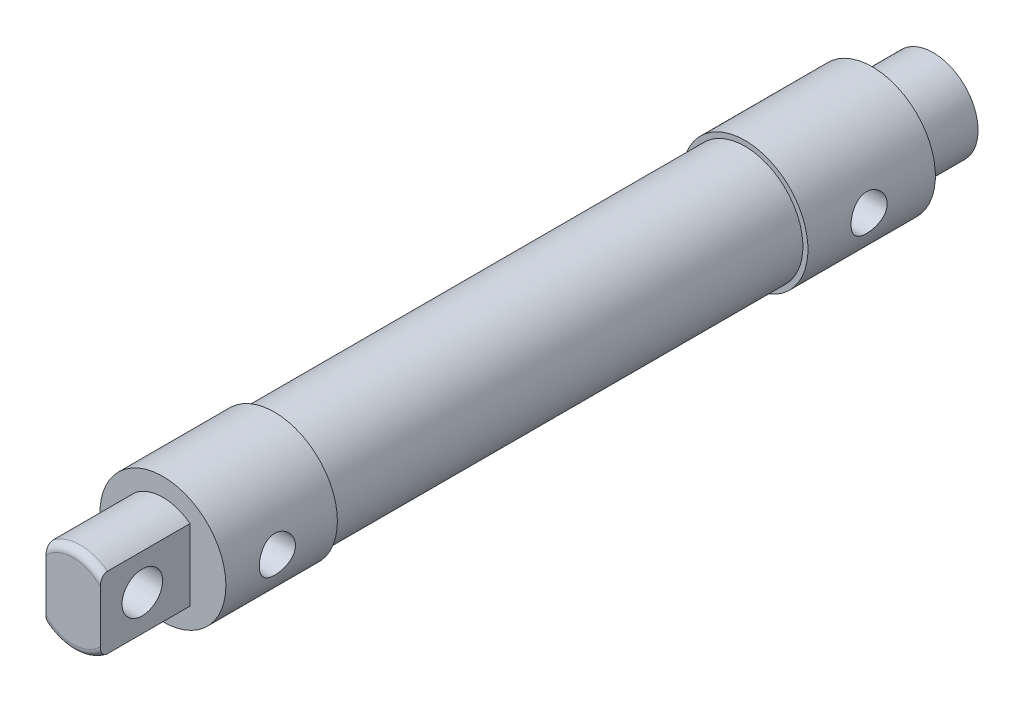
ISO-10303-21;
HEADER;
FILE_DESCRIPTION(('STEP AP214'),'2;1');
FILE_NAME('part.step','',(''),(''),'','','');
FILE_SCHEMA(('AUTOMOTIVE_DESIGN { 1 0 10303 214 1 1 1 1 }'));
ENDSEC;
DATA;
#1=APPLICATION_CONTEXT('core data for automotive mechanical design processes');
#2=APPLICATION_PROTOCOL_DEFINITION('international standard','automotive_design',2000,#1);
#3=PRODUCT_CONTEXT('',#1,'mechanical');
#4=PRODUCT('Part','Part','',(#3));
#5=PRODUCT_RELATED_PRODUCT_CATEGORY('part','',(#4));
#6=PRODUCT_DEFINITION_FORMATION('','',#4);
#7=PRODUCT_DEFINITION_CONTEXT('part definition',#1,'design');
#8=PRODUCT_DEFINITION('design','',#6,#7);
#9=PRODUCT_DEFINITION_SHAPE('','',#8);
#10=(LENGTH_UNIT() NAMED_UNIT(*) SI_UNIT(.MILLI.,.METRE.));
#11=(NAMED_UNIT(*) PLANE_ANGLE_UNIT() SI_UNIT($,.RADIAN.));
#12=(NAMED_UNIT(*) SI_UNIT($,.STERADIAN.) SOLID_ANGLE_UNIT());
#13=UNCERTAINTY_MEASURE_WITH_UNIT(LENGTH_MEASURE(1.E-05),#10,'distance_accuracy_value','');
#14=(GEOMETRIC_REPRESENTATION_CONTEXT(3) GLOBAL_UNCERTAINTY_ASSIGNED_CONTEXT((#13)) GLOBAL_UNIT_ASSIGNED_CONTEXT((#10,
#11,#12)) REPRESENTATION_CONTEXT('',''));
#15=CARTESIAN_POINT('',(0.,0.,0.));
#16=DIRECTION('',(0.,0.,1.));
#17=DIRECTION('',(1.,0.,0.));
#18=AXIS2_PLACEMENT_3D('',#15,#16,#17);
#19=CARTESIAN_POINT('',(0.,0.,102.108));
#20=DIRECTION('',(0.,0.,-1.));
#21=DIRECTION('',(-1.,0.,0.));
#22=AXIS2_PLACEMENT_3D('',#19,#20,#21);
#23=CYLINDRICAL_SURFACE('',#22,11.049);
#24=CARTESIAN_POINT('',(0.,0.,102.108));
#25=DIRECTION('',(0.,0.,1.));
#26=DIRECTION('',(1.,0.,0.));
#27=AXIS2_PLACEMENT_3D('',#24,#25,#26);
#28=CIRCLE('',#27,11.049);
#29=CARTESIAN_POINT('',(11.049,0.,102.108));
#30=VERTEX_POINT('',#29);
#31=EDGE_CURVE('E244',#30,#30,#28,.T.);
#32=ORIENTED_EDGE('',*,*,#31,.F.);
#33=EDGE_LOOP('',(#32));
#34=FACE_BOUND('',#33,.T.);
#35=CARTESIAN_POINT('',(0.,0.,82.55));
#36=DIRECTION('',(0.,0.,1.));
#37=DIRECTION('',(1.,0.,0.));
#38=AXIS2_PLACEMENT_3D('',#35,#36,#37);
#39=CIRCLE('',#38,11.049);
#40=CARTESIAN_POINT('',(11.049,0.,82.55));
#41=VERTEX_POINT('',#40);
#42=EDGE_CURVE('E245',#41,#41,#39,.T.);
#43=ORIENTED_EDGE('',*,*,#42,.T.);
#44=EDGE_LOOP('',(#43));
#45=FACE_BOUND('',#44,.T.);
#46=CARTESIAN_POINT('',(10.5829946612478,-3.175,93.0760778464226));
#47=CARTESIAN_POINT('',(10.5829970378921,-3.17499696173694,93.2504210160346));
#48=CARTESIAN_POINT('',(10.5873499628536,-3.16059101598809,93.4247947914254));
#49=CARTESIAN_POINT('',(10.6042287733974,-3.10348071440142,93.7684686648293));
#50=CARTESIAN_POINT('',(10.6167579154399,-3.06076508315063,93.9377667131465));
#51=CARTESIAN_POINT('',(10.6484555361327,-2.94858604276688,94.266265950174));
#52=CARTESIAN_POINT('',(10.6676136440502,-2.87916439519901,94.4254824534469));
#53=CARTESIAN_POINT('',(10.7103968556723,-2.71567886194747,94.7300428356047));
#54=CARTESIAN_POINT('',(10.7340225055439,-2.62161196278527,94.8753850150505));
#55=CARTESIAN_POINT('',(10.7838478929209,-2.40858326173655,95.1522908243156));
#56=CARTESIAN_POINT('',(10.8100989589948,-2.28903221307923,95.2833920018629));
#57=CARTESIAN_POINT('',(10.8617771284488,-2.02969339145336,95.5239875474528));
#58=CARTESIAN_POINT('',(10.8872041340175,-1.88990322690515,95.63347935838));
#59=CARTESIAN_POINT('',(10.9349482869144,-1.59079703436564,95.8297248552312));
#60=CARTESIAN_POINT('',(10.9571978703645,-1.43116293599986,95.9160116284078));
#61=CARTESIAN_POINT('',(10.9954868205641,-1.09890403668004,96.0603402425021));
#62=CARTESIAN_POINT('',(11.0115274108589,-0.926281803186664,96.1183876488545));
#63=CARTESIAN_POINT('',(11.0352279538983,-0.577780737066135,96.2030726139401));
#64=CARTESIAN_POINT('',(11.0430978601515,-0.402107999548981,96.2304985007207));
#65=CARTESIAN_POINT('',(11.0503076095615,-0.0484902253797742,96.2556497122282));
#66=CARTESIAN_POINT('',(11.0496491013871,0.129454365444954,96.2533807774033));
#67=CARTESIAN_POINT('',(11.0400267625263,0.477051272742408,96.2197461231162));
#68=CARTESIAN_POINT('',(11.0313063870296,0.646793905386179,96.1892332895884));
#69=CARTESIAN_POINT('',(11.0068326238017,0.978639250638321,96.1013641482073));
#70=CARTESIAN_POINT('',(10.991078806017,1.14074149541176,96.0440061989228));
#71=CARTESIAN_POINT('',(10.9539621303433,1.4547904040677,95.9034681087909));
#72=CARTESIAN_POINT('',(10.9325393858836,1.60660549873712,95.8200104285103));
#73=CARTESIAN_POINT('',(10.8863714985496,1.89435605989024,95.6298587495398));
#74=CARTESIAN_POINT('',(10.8616256211488,2.03028800319434,95.5231596104371));
#75=CARTESIAN_POINT('',(10.8104367437012,2.28750533131605,95.2850886155363));
#76=CARTESIAN_POINT('',(10.7839646808932,2.4080998224991,95.1529756044689));
#77=CARTESIAN_POINT('',(10.733084389821,2.62560689303648,94.8701356166965));
#78=CARTESIAN_POINT('',(10.7086763331534,2.72251750463204,94.7194070948998));
#79=CARTESIAN_POINT('',(10.6645569111701,2.89054812362863,94.4019229266747));
#80=CARTESIAN_POINT('',(10.6448854814472,2.96145130546496,94.2350465742272));
#81=CARTESIAN_POINT('',(10.6129476152519,3.07395555813914,93.8910300905357));
#82=CARTESIAN_POINT('',(10.6006789953196,3.11556526969433,93.7138930026082));
#83=CARTESIAN_POINT('',(10.585409663935,3.16704977828252,93.360914762678));
#84=CARTESIAN_POINT('',(10.5821046142205,3.17796715559108,93.185238699667));
#85=CARTESIAN_POINT('',(10.5842985066283,3.17065339734403,92.8345648988625));
#86=CARTESIAN_POINT('',(10.5897963357224,3.15242594683497,92.659567078117));
#87=CARTESIAN_POINT('',(10.6086796202177,3.08826497319619,92.3194335876821));
#88=CARTESIAN_POINT('',(10.6218788212302,3.04298510170739,92.1541632424752));
#89=CARTESIAN_POINT('',(10.654488955992,2.92675343849825,91.8335706419406));
#90=CARTESIAN_POINT('',(10.6739007932801,2.85579791242604,91.6782498375766));
#91=CARTESIAN_POINT('',(10.7173525725105,2.68819763195385,91.3776772532887));
#92=CARTESIAN_POINT('',(10.7414960228918,2.59095536802797,91.2327739732972));
#93=CARTESIAN_POINT('',(10.7914602367789,2.37426353068632,90.9609601536623));
#94=CARTESIAN_POINT('',(10.8172813672868,2.25480908751678,90.8340535703535));
#95=CARTESIAN_POINT('',(10.8687608358398,1.99221286364236,90.5973670912839));
#96=CARTESIAN_POINT('',(10.8943833784092,1.84840048120929,90.4883217183711));
#97=CARTESIAN_POINT('',(10.9416824947104,1.54391896032718,90.2959043170114));
#98=CARTESIAN_POINT('',(10.963359273833,1.38325069997259,90.2125309520897));
#99=CARTESIAN_POINT('',(11.0001869824692,1.05072587538093,90.0746217473224));
#100=CARTESIAN_POINT('',(11.0153871097535,0.8789655035982,90.0198677607017));
#101=CARTESIAN_POINT('',(11.0377661850788,0.528171227762893,89.9401585545153));
#102=CARTESIAN_POINT('',(11.0449472223555,0.349139230810347,89.9151955732998));
#103=CARTESIAN_POINT('',(11.0503629040812,-0.00430043148248762,89.8963271602359));
#104=CARTESIAN_POINT('',(11.0489056996126,-0.178647014664036,89.9013520194536));
#105=CARTESIAN_POINT('',(11.0379233962819,-0.523908669717691,89.9397882629655));
#106=CARTESIAN_POINT('',(11.0283986915624,-0.69482390881254,89.9731982604872));
#107=CARTESIAN_POINT('',(11.0024294098578,-1.0268668171994,90.0668151441214));
#108=CARTESIAN_POINT('',(10.9860488399852,-1.18806963267255,90.1267744555124));
#109=CARTESIAN_POINT('',(10.9480678507565,-1.49821572280081,90.2715676330534));
#110=CARTESIAN_POINT('',(10.9264666173167,-1.64715708060556,90.3564053790612));
#111=CARTESIAN_POINT('',(10.8795235460163,-1.93340384841198,90.5515049284692));
#112=CARTESIAN_POINT('',(10.8540889319086,-2.07022613928248,90.6624530931705));
#113=CARTESIAN_POINT('',(10.8026716112853,-2.32367039959812,90.9053626023441));
#114=CARTESIAN_POINT('',(10.7766887543745,-2.44028674310765,91.0373297795669));
#115=CARTESIAN_POINT('',(10.7263080053237,-2.65311527076294,91.3227581932267));
#116=CARTESIAN_POINT('',(10.7019708346248,-2.7487006048838,91.4766986591247));
#117=CARTESIAN_POINT('',(10.6585601925368,-2.91251111919759,91.7991430987811));
#118=CARTESIAN_POINT('',(10.6394838228281,-2.98075137397164,91.9676389860896));
#119=CARTESIAN_POINT('',(10.6109457090473,-3.08067604297106,92.2918605638783));
#120=CARTESIAN_POINT('',(10.6005573203454,-3.11595595609863,92.4464045642196));
#121=CARTESIAN_POINT('',(10.5865812685406,-3.16311741659185,92.7593169877032));
#122=CARTESIAN_POINT('',(10.5829925020353,-3.17500276030191,92.9176847861173));
#123=CARTESIAN_POINT('',(10.5829946612478,-3.175,93.0760778464226));
#124=B_SPLINE_CURVE_WITH_KNOTS('',3,(#46,#47,#48,#49,#50,#51,#52,#53,#54,#55,#56,#57,#58,#59,
#60,#61,#62,#63,#64,#65,#66,#67,#68,#69,#70,#71,#72,#73,#74,#75,#76,#77,#78,#79,#80,#81,#82,#83,
#84,#85,#86,#87,#88,#89,#90,#91,#92,#93,#94,#95,#96,#97,#98,#99,#100,#101,#102,#103,#104,#105,
#106,#107,#108,#109,#110,#111,#112,#113,#114,#115,#116,#117,#118,#119,#120,#121,#122,#123),
.UNSPECIFIED.,.T.,.F.,(4,2,2,2,2,2,2,2,2,2,2,2,2,2,2,2,2,2,2,2,2,2,2,2,2,2,2,2,2,2,2,2,2,2,2,2,
2,2,4),(0.,0.522445971515646,1.04510015223567,1.56694033248867,2.08884435013764,
2.62446334981218,3.16014569329022,3.70591356848465,4.25157383973313,4.78283705764741,
5.31399757604563,5.82962412489643,6.34528220559616,6.86662167203276,7.38807656264306,
7.92803521591125,8.46803871603087,9.01244709372958,9.55669481951292,10.0822178130475,
10.6076743651684,11.1209208176782,11.6342419484683,12.1603874377864,12.6866484144843,
13.230914757694,13.7751527618185,14.3151795683734,14.8550656473995,15.375811108637,
15.8965311300157,16.4124944283516,16.9285382353606,17.4600631929064,17.9917359057943,
18.5375828018549,19.0831283723763,19.5578544443061,20.0325034738991),.UNSPECIFIED.);
#125=CARTESIAN_POINT('',(10.5829946612478,-3.175,93.0760778464226));
#126=VERTEX_POINT('',#125);
#127=EDGE_CURVE('E139',#126,#126,#124,.T.);
#128=ORIENTED_EDGE('',*,*,#127,.T.);
#129=EDGE_LOOP('',(#128));
#130=FACE_BOUND('',#129,.T.);
#131=ADVANCED_FACE('F48',(#34,#45,#130),#23,.T.);
#132=CARTESIAN_POINT('',(0.,0.,91.948));
#133=DIRECTION('',(0.,0.,-1.));
#134=DIRECTION('',(-1.,0.,0.));
#135=AXIS2_PLACEMENT_3D('',#132,#133,#134);
#136=CYLINDRICAL_SURFACE('',#135,3.175);
#137=CARTESIAN_POINT('',(0.,0.,82.55));
#138=DIRECTION('',(0.,0.,1.));
#139=DIRECTION('',(1.,0.,0.));
#140=AXIS2_PLACEMENT_3D('',#137,#138,#139);
#141=CIRCLE('',#140,3.175);
#142=CARTESIAN_POINT('',(3.175,0.,82.55));
#143=VERTEX_POINT('',#142);
#144=EDGE_CURVE('E53',#143,#143,#141,.T.);
#145=ORIENTED_EDGE('',*,*,#144,.F.);
#146=EDGE_LOOP('',(#145));
#147=FACE_BOUND('',#146,.T.);
#148=CARTESIAN_POINT('',(0.,0.,93.0760778464226));
#149=DIRECTION('',(-0.707106781186548,0.,-0.707106781186547));
#150=DIRECTION('',(-0.707106781186548,0.,0.707106781186547));
#151=AXIS2_PLACEMENT_3D('',#148,#149,#150);
#152=ELLIPSE('',#151,4.49012806053458,3.175);
#153=CARTESIAN_POINT('',(1.12807784642254,-2.96783850174006,91.948));
#154=VERTEX_POINT('',#153);
#155=CARTESIAN_POINT('',(1.12807784642255,2.96783850174005,91.948));
#156=VERTEX_POINT('',#155);
#157=EDGE_CURVE('E144',#154,#156,#152,.F.);
#158=ORIENTED_EDGE('',*,*,#157,.T.);
#159=CARTESIAN_POINT('',(0.,0.,91.948));
#160=DIRECTION('',(0.,0.,-1.));
#161=DIRECTION('',(-1.,0.,0.));
#162=AXIS2_PLACEMENT_3D('',#159,#160,#161);
#163=CIRCLE('',#162,3.175);
#164=EDGE_CURVE('E149',#154,#156,#163,.T.);
#165=ORIENTED_EDGE('',*,*,#164,.F.);
#166=EDGE_LOOP('',(#158,#165));
#167=FACE_BOUND('',#166,.T.);
#168=ADVANCED_FACE('F174',(#147,#167),#136,.F.);
#169=CARTESIAN_POINT('',(0.,0.,91.948));
#170=DIRECTION('',(0.,0.,-1.));
#171=DIRECTION('',(-1.,0.,0.));
#172=AXIS2_PLACEMENT_3D('',#169,#170,#171);
#173=PLANE('',#172);
#174=DIRECTION('',(0.,1.,0.));
#175=VECTOR('',#174,1.);
#176=CARTESIAN_POINT('',(0.,0.,91.948));
#177=LINE('',#176,#175);
#178=CARTESIAN_POINT('',(0.,-2.96783850174005,91.948));
#179=VERTEX_POINT('',#178);
#180=CARTESIAN_POINT('',(0.,2.96783850174005,91.948));
#181=VERTEX_POINT('',#180);
#182=EDGE_CURVE('E138',#179,#181,#177,.T.);
#183=ORIENTED_EDGE('',*,*,#182,.F.);
#184=DIRECTION('',(-1.,0.,0.));
#185=VECTOR('',#184,1.);
#186=CARTESIAN_POINT('',(11.05,-2.96783850174005,91.948));
#187=LINE('',#186,#185);
#188=EDGE_CURVE('E69',#154,#179,#187,.T.);
#189=ORIENTED_EDGE('',*,*,#188,.F.);
#190=ORIENTED_EDGE('',*,*,#164,.T.);
#191=DIRECTION('',(-1.,0.,0.));
#192=VECTOR('',#191,1.);
#193=CARTESIAN_POINT('',(11.05,2.96783850174006,91.948));
#194=LINE('',#193,#192);
#195=EDGE_CURVE('E133',#181,#156,#194,.F.);
#196=ORIENTED_EDGE('',*,*,#195,.F.);
#197=EDGE_LOOP('',(#183,#189,#190,#196));
#198=FACE_BOUND('',#197,.T.);
#199=ADVANCED_FACE('F147',(#198),#173,.T.);
#200=CARTESIAN_POINT('',(0.,0.,102.108));
#201=DIRECTION('',(0.,0.,1.));
#202=DIRECTION('',(1.,0.,0.));
#203=AXIS2_PLACEMENT_3D('',#200,#201,#202);
#204=PLANE('',#203);
#205=ORIENTED_EDGE('',*,*,#31,.T.);
#206=EDGE_LOOP('',(#205));
#207=FACE_BOUND('',#206,.T.);
#208=DIRECTION('',(0.,-1.,0.));
#209=VECTOR('',#208,1.);
#210=CARTESIAN_POINT('',(-4.7625,-6.27044414296148,102.108));
#211=LINE('',#210,#209);
#212=CARTESIAN_POINT('',(-4.7625,6.27044414296148,102.108));
#213=VERTEX_POINT('',#212);
#214=CARTESIAN_POINT('',(-4.7625,-6.27044414296148,102.108));
#215=VERTEX_POINT('',#214);
#216=EDGE_CURVE('E274',#213,#215,#211,.T.);
#217=ORIENTED_EDGE('',*,*,#216,.F.);
#218=CARTESIAN_POINT('',(0.,0.,102.108));
#219=DIRECTION('',(0.,0.,1.));
#220=DIRECTION('',(1.,0.,0.));
#221=AXIS2_PLACEMENT_3D('',#218,#219,#220);
#222=CIRCLE('',#221,7.874);
#223=CARTESIAN_POINT('',(4.7625,6.27044414296148,102.108));
#224=VERTEX_POINT('',#223);
#225=EDGE_CURVE('E278',#224,#213,#222,.T.);
#226=ORIENTED_EDGE('',*,*,#225,.F.);
#227=DIRECTION('',(0.,1.,0.));
#228=VECTOR('',#227,1.);
#229=CARTESIAN_POINT('',(4.7625,-6.27044414296148,102.108));
#230=LINE('',#229,#228);
#231=CARTESIAN_POINT('',(4.7625,-6.27044414296148,102.108));
#232=VERTEX_POINT('',#231);
#233=EDGE_CURVE('E265',#232,#224,#230,.T.);
#234=ORIENTED_EDGE('',*,*,#233,.F.);
#235=CARTESIAN_POINT('',(0.,0.,102.108));
#236=DIRECTION('',(0.,0.,1.));
#237=DIRECTION('',(1.,0.,0.));
#238=AXIS2_PLACEMENT_3D('',#235,#236,#237);
#239=CIRCLE('',#238,7.874);
#240=EDGE_CURVE('E270',#215,#232,#239,.T.);
#241=ORIENTED_EDGE('',*,*,#240,.F.);
#242=EDGE_LOOP('',(#217,#226,#234,#241));
#243=FACE_BOUND('',#242,.T.);
#244=ADVANCED_FACE('F304',(#207,#243),#204,.T.);
#245=CARTESIAN_POINT('',(0.,0.,82.55));
#246=DIRECTION('',(0.,0.,1.));
#247=DIRECTION('',(1.,0.,0.));
#248=AXIS2_PLACEMENT_3D('',#245,#246,#247);
#249=PLANE('',#248);
#250=ORIENTED_EDGE('',*,*,#144,.T.);
#251=EDGE_LOOP('',(#250));
#252=FACE_BOUND('',#251,.T.);
#253=ORIENTED_EDGE('',*,*,#42,.F.);
#254=EDGE_LOOP('',(#253));
#255=FACE_BOUND('',#254,.T.);
#256=ADVANCED_FACE('F185',(#252,#255),#249,.F.);
#257=CARTESIAN_POINT('',(0.,0.,117.856));
#258=DIRECTION('',(0.,0.,-1.));
#259=DIRECTION('',(-1.,0.,0.));
#260=AXIS2_PLACEMENT_3D('',#257,#258,#259);
#261=CYLINDRICAL_SURFACE('',#260,7.874);
#262=DIRECTION('',(0.,0.,-1.));
#263=VECTOR('',#262,1.);
#264=CARTESIAN_POINT('',(-4.7625,6.27044414296148,117.856));
#265=LINE('',#264,#263);
#266=CARTESIAN_POINT('',(-4.7625,6.27044414296148,116.586));
#267=VERTEX_POINT('',#266);
#268=EDGE_CURVE('E249',#267,#213,#265,.T.);
#269=ORIENTED_EDGE('',*,*,#268,.F.);
#270=CARTESIAN_POINT('',(0.,0.,116.586));
#271=DIRECTION('',(0.,0.,1.));
#272=DIRECTION('',(1.,0.,0.));
#273=AXIS2_PLACEMENT_3D('',#270,#271,#272);
#274=CIRCLE('',#273,7.874);
#275=CARTESIAN_POINT('',(4.7625,6.27044414296148,116.586));
#276=VERTEX_POINT('',#275);
#277=EDGE_CURVE('E329',#267,#276,#274,.F.);
#278=ORIENTED_EDGE('',*,*,#277,.T.);
#279=DIRECTION('',(0.,0.,-1.));
#280=VECTOR('',#279,1.);
#281=CARTESIAN_POINT('',(4.7625,6.27044414296148,117.856));
#282=LINE('',#281,#280);
#283=EDGE_CURVE('E261',#276,#224,#282,.T.);
#284=ORIENTED_EDGE('',*,*,#283,.T.);
#285=ORIENTED_EDGE('',*,*,#225,.T.);
#286=EDGE_LOOP('',(#269,#278,#284,#285));
#287=FACE_BOUND('',#286,.T.);
#288=ADVANCED_FACE('F227',(#287),#261,.T.);
#289=CARTESIAN_POINT('',(-4.7625,-6.27044414296148,117.856));
#290=DIRECTION('',(1.,0.,0.));
#291=DIRECTION('',(0.,1.,0.));
#292=AXIS2_PLACEMENT_3D('',#289,#290,#291);
#293=PLANE('',#292);
#294=CARTESIAN_POINT('',(-4.7625,0.,110.49));
#295=DIRECTION('',(1.,0.,0.));
#296=DIRECTION('',(0.,1.,0.));
#297=AXIS2_PLACEMENT_3D('',#294,#295,#296);
#298=CIRCLE('',#297,3.556);
#299=CARTESIAN_POINT('',(-4.7625,3.556,110.49));
#300=VERTEX_POINT('',#299);
#301=EDGE_CURVE('E282',#300,#300,#298,.F.);
#302=ORIENTED_EDGE('',*,*,#301,.F.);
#303=EDGE_LOOP('',(#302));
#304=FACE_BOUND('',#303,.T.);
#305=DIRECTION('',(0.,-1.,0.));
#306=VECTOR('',#305,1.);
#307=CARTESIAN_POINT('',(-4.7625,-6.27044414296148,117.856));
#308=LINE('',#307,#306);
#309=CARTESIAN_POINT('',(-4.7625,4.57508576422344,117.856));
#310=VERTEX_POINT('',#309);
#311=CARTESIAN_POINT('',(-4.7625,-4.57508576422344,117.856));
#312=VERTEX_POINT('',#311);
#313=EDGE_CURVE('E269',#310,#312,#308,.T.);
#314=ORIENTED_EDGE('',*,*,#313,.F.);
#315=CARTESIAN_POINT('',(-4.7625,4.57508576422344,117.856));
#316=CARTESIAN_POINT('',(-4.7625,4.70491371485058,117.855988992306));
#317=CARTESIAN_POINT('',(-4.7625,4.83558278945041,117.84641170347));
#318=CARTESIAN_POINT('',(-4.7625,5.09465420787404,117.804901270244));
#319=CARTESIAN_POINT('',(-4.7625,5.22301707247969,117.772728857364));
#320=CARTESIAN_POINT('',(-4.7625,5.42870338399686,117.697882839221));
#321=CARTESIAN_POINT('',(-4.7625,5.50862070615666,117.662427605347));
#322=CARTESIAN_POINT('',(-4.7625,5.66172310725953,117.579556838602));
#323=CARTESIAN_POINT('',(-4.7625,5.73493413756744,117.532190319702));
#324=CARTESIAN_POINT('',(-4.7625,5.85954621136902,117.43471115017));
#325=CARTESIAN_POINT('',(-4.7625,5.91250696068593,117.386601100032));
#326=CARTESIAN_POINT('',(-4.7625,6.00991201638405,117.282266864641));
#327=CARTESIAN_POINT('',(-4.7625,6.05435186214026,117.226038456345));
#328=CARTESIAN_POINT('',(-4.7625,6.13268330527644,117.105874884677));
#329=CARTESIAN_POINT('',(-4.7625,6.16647767328858,117.041875685665));
#330=CARTESIAN_POINT('',(-4.7625,6.22061826265151,116.908469254315));
#331=CARTESIAN_POINT('',(-4.7625,6.24099787353804,116.839075933595));
#332=CARTESIAN_POINT('',(-4.7625,6.25939312554719,116.738328586812));
#333=CARTESIAN_POINT('',(-4.7625,6.26353112778692,116.708002020549));
#334=CARTESIAN_POINT('',(-4.7625,6.26905575751436,116.647123988509));
#335=CARTESIAN_POINT('',(-4.7625,6.27044458262064,116.616572721978));
#336=CARTESIAN_POINT('',(-4.7625,6.27044414296148,116.586));
#337=B_SPLINE_CURVE_WITH_KNOTS('',3,(#315,#316,#317,#318,#319,#320,#321,#322,#323,#324,#325,
#326,#327,#328,#329,#330,#331,#332,#333,#334,#335,#336),.UNSPECIFIED.,.F.,.F.,(4,2,2,2,2,2,2,2,
2,2,4),(0.,0.39051208259768,0.785223048386074,1.04660172879821,1.30692197058371,
1.52073252531684,1.7346547043959,1.95047758121078,2.16576121964784,2.25747938820261,
2.34912421005433),.UNSPECIFIED.);
#338=EDGE_CURVE('E194',#310,#267,#337,.T.);
#339=ORIENTED_EDGE('',*,*,#338,.T.);
#340=ORIENTED_EDGE('',*,*,#268,.T.);
#341=ORIENTED_EDGE('',*,*,#216,.T.);
#342=DIRECTION('',(0.,0.,-1.));
#343=VECTOR('',#342,1.);
#344=CARTESIAN_POINT('',(-4.7625,-6.27044414296148,117.856));
#345=LINE('',#344,#343);
#346=CARTESIAN_POINT('',(-4.7625,-6.27044414296148,116.586));
#347=VERTEX_POINT('',#346);
#348=EDGE_CURVE('E255',#347,#215,#345,.T.);
#349=ORIENTED_EDGE('',*,*,#348,.F.);
#350=CARTESIAN_POINT('',(-4.7625,-6.27044414296148,116.586));
#351=CARTESIAN_POINT('',(-4.7625,-6.27044695744104,116.616318737493));
#352=CARTESIAN_POINT('',(-4.7625,-6.26907969386893,116.646620938918));
#353=CARTESIAN_POINT('',(-4.7625,-6.26364600379126,116.706969671006));
#354=CARTESIAN_POINT('',(-4.7625,-6.25958072650013,116.737016305011));
#355=CARTESIAN_POINT('',(-4.7625,-6.24346537985301,116.826103039148));
#356=CARTESIAN_POINT('',(-4.7625,-6.22749460557059,116.884476323768));
#357=CARTESIAN_POINT('',(-4.7625,-6.18599695256506,116.997565139999));
#358=CARTESIAN_POINT('',(-4.7625,-6.16048225576697,117.052285230088));
#359=CARTESIAN_POINT('',(-4.7625,-6.10112984915438,117.15705512157));
#360=CARTESIAN_POINT('',(-4.7625,-6.06728241065118,117.207099368899));
#361=CARTESIAN_POINT('',(-4.7625,-5.99039711728846,117.304581778947));
#362=CARTESIAN_POINT('',(-4.7625,-5.9469247650016,117.351675051199));
#363=CARTESIAN_POINT('',(-4.7625,-5.85384044814121,117.439249704828));
#364=CARTESIAN_POINT('',(-4.7625,-5.80422853679333,117.479731143517));
#365=CARTESIAN_POINT('',(-4.7625,-5.67534049300729,117.571859726782));
#366=CARTESIAN_POINT('',(-4.7625,-5.59323792773678,117.619567571663));
#367=CARTESIAN_POINT('',(-4.7625,-5.42216260650941,117.701174178103));
#368=CARTESIAN_POINT('',(-4.7625,-5.33316043671504,117.735009459685));
#369=CARTESIAN_POINT('',(-4.7625,-5.13378043928996,117.795050891071));
#370=CARTESIAN_POINT('',(-4.7625,-5.02259523817668,117.81851969187));
#371=CARTESIAN_POINT('',(-4.7625,-4.79915137908822,117.848894386153));
#372=CARTESIAN_POINT('',(-4.7625,-4.68691720505675,117.855976060827));
#373=CARTESIAN_POINT('',(-4.7625,-4.57508576422344,117.856));
#374=B_SPLINE_CURVE_WITH_KNOTS('',3,(#350,#351,#352,#353,#354,#355,#356,#357,#358,#359,#360,
#361,#362,#363,#364,#365,#366,#367,#368,#369,#370,#371,#372,#373),.UNSPECIFIED.,.F.,.F.,(4,2,2,
2,2,2,2,2,2,2,2,4),(0.,0.0908934298733058,0.181748168669605,0.362315077107739,0.542652290896589,
0.723201059897704,0.91475718163734,1.10631164283679,1.38961771540344,1.67420608669171,
2.01378321177532,2.34970053458326),.UNSPECIFIED.);
#375=EDGE_CURVE('E230',#347,#312,#374,.T.);
#376=ORIENTED_EDGE('',*,*,#375,.T.);
#377=EDGE_LOOP('',(#314,#339,#340,#341,#349,#376));
#378=FACE_BOUND('',#377,.T.);
#379=ADVANCED_FACE('F222',(#304,#378),#293,.F.);
#380=CARTESIAN_POINT('',(0.,0.,117.856));
#381=DIRECTION('',(0.,0.,-1.));
#382=DIRECTION('',(-1.,0.,0.));
#383=AXIS2_PLACEMENT_3D('',#380,#381,#382);
#384=CYLINDRICAL_SURFACE('',#383,7.874);
#385=DIRECTION('',(0.,0.,-1.));
#386=VECTOR('',#385,1.);
#387=CARTESIAN_POINT('',(4.7625,-6.27044414296148,117.856));
#388=LINE('',#387,#386);
#389=CARTESIAN_POINT('',(4.7625,-6.27044414296148,116.586));
#390=VERTEX_POINT('',#389);
#391=EDGE_CURVE('E258',#390,#232,#388,.T.);
#392=ORIENTED_EDGE('',*,*,#391,.F.);
#393=CARTESIAN_POINT('',(0.,0.,116.586));
#394=DIRECTION('',(0.,0.,1.));
#395=DIRECTION('',(1.,0.,0.));
#396=AXIS2_PLACEMENT_3D('',#393,#394,#395);
#397=CIRCLE('',#396,7.874);
#398=EDGE_CURVE('E12',#390,#347,#397,.F.);
#399=ORIENTED_EDGE('',*,*,#398,.T.);
#400=ORIENTED_EDGE('',*,*,#348,.T.);
#401=ORIENTED_EDGE('',*,*,#240,.T.);
#402=EDGE_LOOP('',(#392,#399,#400,#401));
#403=FACE_BOUND('',#402,.T.);
#404=ADVANCED_FACE('F217',(#403),#384,.T.);
#405=CARTESIAN_POINT('',(4.7625,-6.27044414296148,117.856));
#406=DIRECTION('',(-1.,0.,0.));
#407=DIRECTION('',(0.,0.,1.));
#408=AXIS2_PLACEMENT_3D('',#405,#406,#407);
#409=PLANE('',#408);
#410=CARTESIAN_POINT('',(4.7625,0.,110.49));
#411=DIRECTION('',(1.,0.,0.));
#412=DIRECTION('',(0.,0.,-1.));
#413=AXIS2_PLACEMENT_3D('',#410,#411,#412);
#414=CIRCLE('',#413,3.556);
#415=CARTESIAN_POINT('',(4.7625,0.,106.934));
#416=VERTEX_POINT('',#415);
#417=EDGE_CURVE('E291',#416,#416,#414,.T.);
#418=ORIENTED_EDGE('',*,*,#417,.F.);
#419=EDGE_LOOP('',(#418));
#420=FACE_BOUND('',#419,.T.);
#421=ORIENTED_EDGE('',*,*,#283,.F.);
#422=CARTESIAN_POINT('',(4.7625,6.27044414296148,116.586));
#423=CARTESIAN_POINT('',(4.7625,6.27044695744104,116.616318737493));
#424=CARTESIAN_POINT('',(4.7625,6.26907969386893,116.646620938918));
#425=CARTESIAN_POINT('',(4.7625,6.26364600379127,116.706969671006));
#426=CARTESIAN_POINT('',(4.7625,6.25958072650013,116.737016305011));
#427=CARTESIAN_POINT('',(4.7625,6.24346537985301,116.826103039148));
#428=CARTESIAN_POINT('',(4.7625,6.22749460557059,116.884476323768));
#429=CARTESIAN_POINT('',(4.7625,6.18599695256506,116.997565139999));
#430=CARTESIAN_POINT('',(4.7625,6.16048225576698,117.052285230088));
#431=CARTESIAN_POINT('',(4.7625,6.1011298491544,117.15705512157));
#432=CARTESIAN_POINT('',(4.7625,6.06728241065119,117.207099368899));
#433=CARTESIAN_POINT('',(4.7625,5.99039711728846,117.304581778947));
#434=CARTESIAN_POINT('',(4.7625,5.9469247650016,117.351675051199));
#435=CARTESIAN_POINT('',(4.7625,5.85384044814121,117.439249704828));
#436=CARTESIAN_POINT('',(4.7625,5.80422853679333,117.479731143517));
#437=CARTESIAN_POINT('',(4.7625,5.6753404930073,117.571859726782));
#438=CARTESIAN_POINT('',(4.7625,5.59323792773679,117.619567571663));
#439=CARTESIAN_POINT('',(4.7625,5.42216260650943,117.701174178103));
#440=CARTESIAN_POINT('',(4.7625,5.33316043671506,117.735009459685));
#441=CARTESIAN_POINT('',(4.7625,5.13378043928998,117.795050891071));
#442=CARTESIAN_POINT('',(4.7625,5.02259523817669,117.81851969187));
#443=CARTESIAN_POINT('',(4.7625,4.79915137908822,117.848894386153));
#444=CARTESIAN_POINT('',(4.7625,4.68691720505676,117.855976060827));
#445=CARTESIAN_POINT('',(4.7625,4.57508576422344,117.856));
#446=B_SPLINE_CURVE_WITH_KNOTS('',3,(#422,#423,#424,#425,#426,#427,#428,#429,#430,#431,#432,
#433,#434,#435,#436,#437,#438,#439,#440,#441,#442,#443,#444,#445),.UNSPECIFIED.,.F.,.F.,(4,2,2,
2,2,2,2,2,2,2,2,4),(0.,0.0908934298733058,0.181748168669605,0.362315077107739,0.542652290896557,
0.723201059897703,0.914757181637344,1.10631164283678,1.38961771540342,1.67420608669169,
2.01378321177531,2.34970053458325),.UNSPECIFIED.);
#447=CARTESIAN_POINT('',(4.7625,4.57508576422344,117.856));
#448=VERTEX_POINT('',#447);
#449=EDGE_CURVE('E59',#276,#448,#446,.T.);
#450=ORIENTED_EDGE('',*,*,#449,.T.);
#451=DIRECTION('',(0.,1.,0.));
#452=VECTOR('',#451,1.);
#453=CARTESIAN_POINT('',(4.7625,-6.27044414296148,117.856));
#454=LINE('',#453,#452);
#455=CARTESIAN_POINT('',(4.7625,-4.57508576422344,117.856));
#456=VERTEX_POINT('',#455);
#457=EDGE_CURVE('E264',#456,#448,#454,.T.);
#458=ORIENTED_EDGE('',*,*,#457,.F.);
#459=CARTESIAN_POINT('',(4.7625,-4.57508576422344,117.856));
#460=CARTESIAN_POINT('',(4.7625,-4.70491371485058,117.855988992306));
#461=CARTESIAN_POINT('',(4.7625,-4.83558278945041,117.84641170347));
#462=CARTESIAN_POINT('',(4.7625,-5.09465420787404,117.804901270244));
#463=CARTESIAN_POINT('',(4.7625,-5.22301707247968,117.772728857364));
#464=CARTESIAN_POINT('',(4.7625,-5.42870338399685,117.697882839221));
#465=CARTESIAN_POINT('',(4.7625,-5.50862070615666,117.662427605347));
#466=CARTESIAN_POINT('',(4.7625,-5.66172310725953,117.579556838602));
#467=CARTESIAN_POINT('',(4.7625,-5.73493413756743,117.532190319702));
#468=CARTESIAN_POINT('',(4.7625,-5.85954621136902,117.43471115017));
#469=CARTESIAN_POINT('',(4.7625,-5.91250696068594,117.386601100032));
#470=CARTESIAN_POINT('',(4.7625,-6.00991201638405,117.282266864641));
#471=CARTESIAN_POINT('',(4.7625,-6.05435186214026,117.226038456345));
#472=CARTESIAN_POINT('',(4.7625,-6.13268330527643,117.105874884677));
#473=CARTESIAN_POINT('',(4.7625,-6.16647767328858,117.041875685665));
#474=CARTESIAN_POINT('',(4.7625,-6.22061826265151,116.908469254315));
#475=CARTESIAN_POINT('',(4.7625,-6.24099787353804,116.839075933595));
#476=CARTESIAN_POINT('',(4.7625,-6.25939312554719,116.738328586812));
#477=CARTESIAN_POINT('',(4.7625,-6.26353112778692,116.708002020549));
#478=CARTESIAN_POINT('',(4.7625,-6.26905575751435,116.647123988509));
#479=CARTESIAN_POINT('',(4.7625,-6.27044458262064,116.616572721978));
#480=CARTESIAN_POINT('',(4.7625,-6.27044414296148,116.586));
#481=B_SPLINE_CURVE_WITH_KNOTS('',3,(#459,#460,#461,#462,#463,#464,#465,#466,#467,#468,#469,
#470,#471,#472,#473,#474,#475,#476,#477,#478,#479,#480),.UNSPECIFIED.,.F.,.F.,(4,2,2,2,2,2,2,2,
2,2,4),(0.,0.390512082597678,0.785223048386074,1.04660172879821,1.30692197058371,
1.52073252531686,1.7346547043959,1.95047758121078,2.16576121964783,2.25747938820261,
2.34912421005431),.UNSPECIFIED.);
#482=EDGE_CURVE('E80',#456,#390,#481,.T.);
#483=ORIENTED_EDGE('',*,*,#482,.T.);
#484=ORIENTED_EDGE('',*,*,#391,.T.);
#485=ORIENTED_EDGE('',*,*,#233,.T.);
#486=EDGE_LOOP('',(#421,#450,#458,#483,#484,#485));
#487=FACE_BOUND('',#486,.T.);
#488=ADVANCED_FACE('F211',(#420,#487),#409,.F.);
#489=CARTESIAN_POINT('',(0.,0.,117.856));
#490=DIRECTION('',(0.,0.,1.));
#491=DIRECTION('',(1.,0.,0.));
#492=AXIS2_PLACEMENT_3D('',#489,#490,#491);
#493=PLANE('',#492);
#494=ORIENTED_EDGE('',*,*,#457,.T.);
#495=CARTESIAN_POINT('',(0.,0.,117.856));
#496=DIRECTION('',(0.,0.,1.));
#497=DIRECTION('',(1.,0.,0.));
#498=AXIS2_PLACEMENT_3D('',#495,#496,#497);
#499=CIRCLE('',#498,6.604);
#500=EDGE_CURVE('E236',#448,#310,#499,.T.);
#501=ORIENTED_EDGE('',*,*,#500,.T.);
#502=ORIENTED_EDGE('',*,*,#313,.T.);
#503=CARTESIAN_POINT('',(0.,0.,117.856));
#504=DIRECTION('',(0.,0.,1.));
#505=DIRECTION('',(1.,0.,0.));
#506=AXIS2_PLACEMENT_3D('',#503,#504,#505);
#507=CIRCLE('',#506,6.604);
#508=EDGE_CURVE('E240',#312,#456,#507,.T.);
#509=ORIENTED_EDGE('',*,*,#508,.T.);
#510=EDGE_LOOP('',(#494,#501,#502,#509));
#511=FACE_BOUND('',#510,.T.);
#512=ADVANCED_FACE('F216',(#511),#493,.T.);
#513=CARTESIAN_POINT('',(-11.05,0.,110.49));
#514=DIRECTION('',(1.,0.,0.));
#515=DIRECTION('',(0.,0.,-1.));
#516=AXIS2_PLACEMENT_3D('',#513,#514,#515);
#517=CYLINDRICAL_SURFACE('',#516,3.556);
#518=ORIENTED_EDGE('',*,*,#417,.T.);
#519=EDGE_LOOP('',(#518));
#520=FACE_BOUND('',#519,.T.);
#521=ORIENTED_EDGE('',*,*,#301,.T.);
#522=EDGE_LOOP('',(#521));
#523=FACE_BOUND('',#522,.T.);
#524=ADVANCED_FACE('F190',(#520,#523),#517,.F.);
#525=CARTESIAN_POINT('',(0.,0.,116.586));
#526=DIRECTION('',(0.,0.,1.));
#527=DIRECTION('',(1.,0.,0.));
#528=AXIS2_PLACEMENT_3D('',#525,#526,#527);
#529=TOROIDAL_SURFACE('',#528,6.604,1.27);
#530=ORIENTED_EDGE('',*,*,#449,.F.);
#531=ORIENTED_EDGE('',*,*,#277,.F.);
#532=ORIENTED_EDGE('',*,*,#338,.F.);
#533=ORIENTED_EDGE('',*,*,#500,.F.);
#534=EDGE_LOOP('',(#530,#531,#532,#533));
#535=FACE_BOUND('',#534,.T.);
#536=ADVANCED_FACE('F187',(#535),#529,.T.);
#537=CARTESIAN_POINT('',(0.,0.,116.586));
#538=DIRECTION('',(0.,0.,1.));
#539=DIRECTION('',(1.,0.,0.));
#540=AXIS2_PLACEMENT_3D('',#537,#538,#539);
#541=TOROIDAL_SURFACE('',#540,6.604,1.27);
#542=ORIENTED_EDGE('',*,*,#375,.F.);
#543=ORIENTED_EDGE('',*,*,#398,.F.);
#544=ORIENTED_EDGE('',*,*,#482,.F.);
#545=ORIENTED_EDGE('',*,*,#508,.F.);
#546=EDGE_LOOP('',(#542,#543,#544,#545));
#547=FACE_BOUND('',#546,.T.);
#548=ADVANCED_FACE('F50',(#547),#541,.T.);
#549=CARTESIAN_POINT('',(11.05,0.,93.0760778464226));
#550=DIRECTION('',(-1.,0.,0.));
#551=DIRECTION('',(0.,-1.,0.));
#552=AXIS2_PLACEMENT_3D('',#549,#550,#551);
#553=CYLINDRICAL_SURFACE('',#552,3.175);
#554=ORIENTED_EDGE('',*,*,#188,.T.);
#555=CARTESIAN_POINT('',(0.,0.,93.0760778464226));
#556=DIRECTION('',(1.,0.,0.));
#557=DIRECTION('',(0.,1.,0.));
#558=AXIS2_PLACEMENT_3D('',#555,#556,#557);
#559=CIRCLE('',#558,3.175);
#560=EDGE_CURVE('E128',#181,#179,#559,.T.);
#561=ORIENTED_EDGE('',*,*,#560,.F.);
#562=ORIENTED_EDGE('',*,*,#195,.T.);
#563=ORIENTED_EDGE('',*,*,#157,.F.);
#564=EDGE_LOOP('',(#554,#561,#562,#563));
#565=FACE_BOUND('',#564,.T.);
#566=ORIENTED_EDGE('',*,*,#127,.F.);
#567=EDGE_LOOP('',(#566));
#568=FACE_BOUND('',#567,.T.);
#569=ADVANCED_FACE('F130',(#565,#568),#553,.F.);
#570=CARTESIAN_POINT('',(0.,0.,93.0760778464226));
#571=DIRECTION('',(1.,0.,0.));
#572=DIRECTION('',(0.,1.,0.));
#573=AXIS2_PLACEMENT_3D('',#570,#571,#572);
#574=PLANE('',#573);
#575=ORIENTED_EDGE('',*,*,#182,.T.);
#576=ORIENTED_EDGE('',*,*,#560,.T.);
#577=EDGE_LOOP('',(#575,#576));
#578=FACE_BOUND('',#577,.T.);
#579=ADVANCED_FACE('F141',(#578),#574,.T.);
#580=CLOSED_SHELL('',(#131,#168,#199,#244,#256,#288,#379,#404,#488,#512,#524,#536,#548,#569,#579));
#581=MANIFOLD_SOLID_BREP('B2',#580);
#582=CARTESIAN_POINT('',(0.,0.,-22.352));
#583=DIRECTION('',(0.,0.,1.));
#584=DIRECTION('',(1.,0.,0.));
#585=AXIS2_PLACEMENT_3D('',#582,#583,#584);
#586=CYLINDRICAL_SURFACE('',#585,11.049);
#587=CARTESIAN_POINT('',(0.,0.,-22.352));
#588=DIRECTION('',(0.,0.,-1.));
#589=DIRECTION('',(-1.,0.,0.));
#590=AXIS2_PLACEMENT_3D('',#587,#588,#589);
#591=CIRCLE('',#590,11.049);
#592=CARTESIAN_POINT('',(-11.049,0.,-22.352));
#593=VERTEX_POINT('',#592);
#594=EDGE_CURVE('E511',#593,#593,#591,.T.);
#595=ORIENTED_EDGE('',*,*,#594,.F.);
#596=EDGE_LOOP('',(#595));
#597=FACE_BOUND('',#596,.T.);
#598=CARTESIAN_POINT('',(0.,0.,0.));
#599=DIRECTION('',(0.,0.,-1.));
#600=DIRECTION('',(-1.,0.,0.));
#601=AXIS2_PLACEMENT_3D('',#598,#599,#600);
#602=CIRCLE('',#601,11.049);
#603=CARTESIAN_POINT('',(-11.049,0.,0.));
#604=VERTEX_POINT('',#603);
#605=EDGE_CURVE('E515',#604,#604,#602,.T.);
#606=ORIENTED_EDGE('',*,*,#605,.T.);
#607=EDGE_LOOP('',(#606));
#608=FACE_BOUND('',#607,.T.);
#609=CARTESIAN_POINT('',(10.5829946612478,-3.175,-10.7397975431835));
#610=CARTESIAN_POINT('',(10.5829970378921,-3.17499696173694,-10.5654543735715));
#611=CARTESIAN_POINT('',(10.5873499628536,-3.16059101598809,-10.3910805981808));
#612=CARTESIAN_POINT('',(10.6042287733974,-3.10348071440142,-10.0474067247768));
#613=CARTESIAN_POINT('',(10.6167579154399,-3.06076508315063,-9.8781086764596));
#614=CARTESIAN_POINT('',(10.6484555361327,-2.94858604276688,-9.54960943943213));
#615=CARTESIAN_POINT('',(10.6676136440502,-2.87916439519901,-9.39039293615923));
#616=CARTESIAN_POINT('',(10.7103968556723,-2.71567886194747,-9.08583255400147));
#617=CARTESIAN_POINT('',(10.7340225055439,-2.62161196278527,-8.94049037455566));
#618=CARTESIAN_POINT('',(10.7838478929209,-2.40858326173655,-8.6635845652905));
#619=CARTESIAN_POINT('',(10.8100989589948,-2.28903221307923,-8.53248338774322));
#620=CARTESIAN_POINT('',(10.8617771284488,-2.02969339145336,-8.29188784215332));
#621=CARTESIAN_POINT('',(10.8872041340175,-1.88990322690514,-8.18239603122611));
#622=CARTESIAN_POINT('',(10.9349482869144,-1.59079703436564,-7.98615053437497));
#623=CARTESIAN_POINT('',(10.9571978703645,-1.43116293599986,-7.89986376119828));
#624=CARTESIAN_POINT('',(10.9954868205641,-1.09890403668005,-7.75553514710404));
#625=CARTESIAN_POINT('',(11.0115274108589,-0.926281803186664,-7.69748774075162));
#626=CARTESIAN_POINT('',(11.0352279538983,-0.577780737066133,-7.61280277566601));
#627=CARTESIAN_POINT('',(11.0430978601515,-0.40210799954898,-7.58537688888545));
#628=CARTESIAN_POINT('',(11.0503076095615,-0.0484902253797718,-7.56022567737788));
#629=CARTESIAN_POINT('',(11.0496491013871,0.129454365444957,-7.56249461220288));
#630=CARTESIAN_POINT('',(11.0400267625263,0.477051272742411,-7.59612926648995));
#631=CARTESIAN_POINT('',(11.0313063870296,0.646793905386182,-7.62664210001776));
#632=CARTESIAN_POINT('',(11.0068326238017,0.978639250638324,-7.71451124139882));
#633=CARTESIAN_POINT('',(10.991078806017,1.14074149541176,-7.77186919068333));
#634=CARTESIAN_POINT('',(10.9539621303433,1.4547904040677,-7.91240728081524));
#635=CARTESIAN_POINT('',(10.9325393858836,1.60660549873712,-7.99586496109587));
#636=CARTESIAN_POINT('',(10.8863714985496,1.89435605989024,-8.18601664006632));
#637=CARTESIAN_POINT('',(10.8616256211488,2.03028800319434,-8.29271577916901));
#638=CARTESIAN_POINT('',(10.8104367437012,2.28750533131605,-8.53078677406985));
#639=CARTESIAN_POINT('',(10.7839646808932,2.4080998224991,-8.66289978513723));
#640=CARTESIAN_POINT('',(10.733084389821,2.62560689303649,-8.94573977290962));
#641=CARTESIAN_POINT('',(10.7086763331534,2.72251750463205,-9.09646829470636));
#642=CARTESIAN_POINT('',(10.6645569111701,2.89054812362863,-9.41395246293139));
#643=CARTESIAN_POINT('',(10.6448854814472,2.96145130546497,-9.58082881537895));
#644=CARTESIAN_POINT('',(10.6129476152519,3.07395555813915,-9.9248452990704));
#645=CARTESIAN_POINT('',(10.6006789953196,3.11556526969434,-10.1019823869979));
#646=CARTESIAN_POINT('',(10.585409663935,3.16704977828252,-10.4549606269282));
#647=CARTESIAN_POINT('',(10.5821046142205,3.17796715559108,-10.6306366899391));
#648=CARTESIAN_POINT('',(10.5842985066283,3.17065339734403,-10.9813104907436));
#649=CARTESIAN_POINT('',(10.5897963357224,3.15242594683498,-11.1563083114892));
#650=CARTESIAN_POINT('',(10.6086796202177,3.0882649731962,-11.496441801924));
#651=CARTESIAN_POINT('',(10.6218788212302,3.04298510170739,-11.6617121471309));
#652=CARTESIAN_POINT('',(10.654488955992,2.92675343849825,-11.9823047476655));
#653=CARTESIAN_POINT('',(10.6739007932801,2.85579791242604,-12.1376255520295));
#654=CARTESIAN_POINT('',(10.7173525725105,2.68819763195385,-12.4381981363175));
#655=CARTESIAN_POINT('',(10.7414960228918,2.59095536802797,-12.583101416309));
#656=CARTESIAN_POINT('',(10.7914602367789,2.37426353068632,-12.8549152359438));
#657=CARTESIAN_POINT('',(10.8172813672868,2.25480908751678,-12.9818218192526));
#658=CARTESIAN_POINT('',(10.8687608358398,1.99221286364236,-13.2185082983223));
#659=CARTESIAN_POINT('',(10.8943833784092,1.84840048120928,-13.327553671235));
#660=CARTESIAN_POINT('',(10.9416824947104,1.54391896032718,-13.5199710725948));
#661=CARTESIAN_POINT('',(10.963359273833,1.38325069997259,-13.6033444375164));
#662=CARTESIAN_POINT('',(11.0001869824692,1.05072587538093,-13.7412536422838));
#663=CARTESIAN_POINT('',(11.0153871097535,0.878965503598196,-13.7960076289044));
#664=CARTESIAN_POINT('',(11.0377661850788,0.528171227762888,-13.8757168350909));
#665=CARTESIAN_POINT('',(11.0449472223555,0.349139230810344,-13.9006798163064));
#666=CARTESIAN_POINT('',(11.0503629040812,-0.00430043148248949,-13.9195482293702));
#667=CARTESIAN_POINT('',(11.0489056996126,-0.178647014664038,-13.9145233701525));
#668=CARTESIAN_POINT('',(11.0379233962819,-0.523908669717694,-13.8760871266407));
#669=CARTESIAN_POINT('',(11.0283986915624,-0.694823908812544,-13.8426771291189));
#670=CARTESIAN_POINT('',(11.0024294098578,-1.02686681719941,-13.7490602454847));
#671=CARTESIAN_POINT('',(10.9860488399852,-1.18806963267256,-13.6891009340937));
#672=CARTESIAN_POINT('',(10.9480678507565,-1.49821572280081,-13.5443077565527));
#673=CARTESIAN_POINT('',(10.9264666173167,-1.64715708060556,-13.4594700105449));
#674=CARTESIAN_POINT('',(10.8795235460163,-1.93340384841199,-13.2643704611369));
#675=CARTESIAN_POINT('',(10.8540889319086,-2.07022613928248,-13.1534222964356));
#676=CARTESIAN_POINT('',(10.8026716112853,-2.32367039959813,-12.9105127872621));
#677=CARTESIAN_POINT('',(10.7766887543745,-2.44028674310766,-12.7785456100392));
#678=CARTESIAN_POINT('',(10.7263080053237,-2.65311527076294,-12.4931171963795));
#679=CARTESIAN_POINT('',(10.7019708346248,-2.74870060488379,-12.3391767304814));
#680=CARTESIAN_POINT('',(10.6585601925368,-2.91251111919758,-12.016732290825));
#681=CARTESIAN_POINT('',(10.6394838228281,-2.98075137397164,-11.8482364035165));
#682=CARTESIAN_POINT('',(10.6109457090473,-3.08067604297106,-11.5240148257279));
#683=CARTESIAN_POINT('',(10.6005573203454,-3.11595595609863,-11.3694708253865));
#684=CARTESIAN_POINT('',(10.5865812685406,-3.16311741659185,-11.0565584019029));
#685=CARTESIAN_POINT('',(10.5829925020353,-3.17500276030191,-10.8981906034888));
#686=CARTESIAN_POINT('',(10.5829946612478,-3.175,-10.7397975431835));
#687=B_SPLINE_CURVE_WITH_KNOTS('',3,(#609,#610,#611,#612,#613,#614,#615,#616,#617,#618,#619,
#620,#621,#622,#623,#624,#625,#626,#627,#628,#629,#630,#631,#632,#633,#634,#635,#636,#637,#638,
#639,#640,#641,#642,#643,#644,#645,#646,#647,#648,#649,#650,#651,#652,#653,#654,#655,#656,#657,
#658,#659,#660,#661,#662,#663,#664,#665,#666,#667,#668,#669,#670,#671,#672,#673,#674,#675,#676,
#677,#678,#679,#680,#681,#682,#683,#684,#685,#686),.UNSPECIFIED.,.T.,.F.,(4,2,2,2,2,2,2,2,2,2,2,
2,2,2,2,2,2,2,2,2,2,2,2,2,2,2,2,2,2,2,2,2,2,2,2,2,2,2,4),(0.,0.52244597151565,1.04510015223567,
1.56694033248867,2.08884435013764,2.6244633498122,3.16014569329022,3.70591356848466,
4.25157383973314,4.78283705764742,5.31399757604564,5.82962412489644,6.34528220559617,
6.86662167203276,7.38807656264306,7.92803521591126,8.46803871603088,9.01244709372958,
9.55669481951293,10.0822178130475,10.6076743651684,11.1209208176782,11.6342419484684,
12.1603874377864,12.6866484144844,13.230914757694,13.7751527618185,14.3151795683734,
14.8550656473995,15.375811108637,15.8965311300157,16.4124944283517,16.9285382353607,
17.4600631929064,17.9917359057943,18.5375828018549,19.0831283723763,19.5578544443061,
20.0325034738991),.UNSPECIFIED.);
#688=CARTESIAN_POINT('',(10.5829946612478,-3.175,-10.7397975431835));
#689=VERTEX_POINT('',#688);
#690=EDGE_CURVE('E458',#689,#689,#687,.T.);
#691=ORIENTED_EDGE('',*,*,#690,.T.);
#692=EDGE_LOOP('',(#691));
#693=FACE_BOUND('',#692,.T.);
#694=ADVANCED_FACE('F431',(#597,#608,#693),#586,.T.);
#695=CARTESIAN_POINT('',(0.,0.,91.948));
#696=DIRECTION('',(0.,0.,-1.));
#697=DIRECTION('',(-1.,0.,0.));
#698=AXIS2_PLACEMENT_3D('',#695,#696,#697);
#699=CYLINDRICAL_SURFACE('',#698,3.175);
#700=CARTESIAN_POINT('',(0.,0.,-33.02));
#701=DIRECTION('',(0.,0.,-1.));
#702=DIRECTION('',(-1.,0.,0.));
#703=AXIS2_PLACEMENT_3D('',#700,#701,#702);
#704=CIRCLE('',#703,3.175);
#705=CARTESIAN_POINT('',(-3.175,0.,-33.02));
#706=VERTEX_POINT('',#705);
#707=EDGE_CURVE('E462',#706,#706,#704,.T.);
#708=ORIENTED_EDGE('',*,*,#707,.T.);
#709=EDGE_LOOP('',(#708));
#710=FACE_BOUND('',#709,.T.);
#711=CARTESIAN_POINT('',(0.,0.,82.55));
#712=DIRECTION('',(0.,0.,1.));
#713=DIRECTION('',(1.,0.,0.));
#714=AXIS2_PLACEMENT_3D('',#711,#712,#713);
#715=CIRCLE('',#714,3.175);
#716=CARTESIAN_POINT('',(3.175,0.,82.55));
#717=VERTEX_POINT('',#716);
#718=EDGE_CURVE('E505',#717,#717,#715,.T.);
#719=ORIENTED_EDGE('',*,*,#718,.T.);
#720=EDGE_LOOP('',(#719));
#721=FACE_BOUND('',#720,.T.);
#722=CARTESIAN_POINT('',(0.,0.,-10.7397975431835));
#723=DIRECTION('',(-0.707106781186548,0.,-0.707106781186547));
#724=DIRECTION('',(-0.707106781186548,0.,0.707106781186547));
#725=AXIS2_PLACEMENT_3D('',#722,#723,#724);
#726=ELLIPSE('',#725,4.49012806053458,3.175);
#727=CARTESIAN_POINT('',(0.,-3.175,-10.7397975431835));
#728=VERTEX_POINT('',#727);
#729=CARTESIAN_POINT('',(0.,3.175,-10.7397975431835));
#730=VERTEX_POINT('',#729);
#731=EDGE_CURVE('E448',#728,#730,#726,.F.);
#732=ORIENTED_EDGE('',*,*,#731,.T.);
#733=CARTESIAN_POINT('',(0.,0.,-10.7397975431835));
#734=DIRECTION('',(-0.707106781186548,0.,0.707106781186547));
#735=DIRECTION('',(-0.707106781186548,0.,-0.707106781186547));
#736=AXIS2_PLACEMENT_3D('',#733,#734,#735);
#737=ELLIPSE('',#736,4.49012806053458,3.175);
#738=EDGE_CURVE('E450',#730,#728,#737,.F.);
#739=ORIENTED_EDGE('',*,*,#738,.T.);
#740=EDGE_LOOP('',(#732,#739));
#741=FACE_BOUND('',#740,.T.);
#742=ADVANCED_FACE('F456',(#710,#721,#741),#699,.F.);
#743=CARTESIAN_POINT('',(0.,0.,82.55));
#744=DIRECTION('',(0.,0.,-1.));
#745=DIRECTION('',(-1.,0.,0.));
#746=AXIS2_PLACEMENT_3D('',#743,#744,#745);
#747=CYLINDRICAL_SURFACE('',#746,10.16);
#748=CARTESIAN_POINT('',(0.,0.,82.55));
#749=DIRECTION('',(0.,0.,1.));
#750=DIRECTION('',(1.,0.,0.));
#751=AXIS2_PLACEMENT_3D('',#748,#749,#750);
#752=CIRCLE('',#751,10.16);
#753=CARTESIAN_POINT('',(10.16,0.,82.55));
#754=VERTEX_POINT('',#753);
#755=EDGE_CURVE('E46',#754,#754,#752,.T.);
#756=ORIENTED_EDGE('',*,*,#755,.F.);
#757=EDGE_LOOP('',(#756));
#758=FACE_BOUND('',#757,.T.);
#759=CARTESIAN_POINT('',(0.,0.,0.));
#760=DIRECTION('',(0.,0.,-1.));
#761=DIRECTION('',(-1.,0.,0.));
#762=AXIS2_PLACEMENT_3D('',#759,#760,#761);
#763=CIRCLE('',#762,10.16);
#764=CARTESIAN_POINT('',(-10.16,0.,0.));
#765=VERTEX_POINT('',#764);
#766=EDGE_CURVE('E440',#765,#765,#763,.T.);
#767=ORIENTED_EDGE('',*,*,#766,.F.);
#768=EDGE_LOOP('',(#767));
#769=FACE_BOUND('',#768,.T.);
#770=ADVANCED_FACE('F433',(#758,#769),#747,.T.);
#771=CARTESIAN_POINT('',(0.,0.,82.55));
#772=DIRECTION('',(0.,0.,1.));
#773=DIRECTION('',(1.,0.,0.));
#774=AXIS2_PLACEMENT_3D('',#771,#772,#773);
#775=PLANE('',#774);
#776=ORIENTED_EDGE('',*,*,#718,.F.);
#777=EDGE_LOOP('',(#776));
#778=FACE_BOUND('',#777,.T.);
#779=ORIENTED_EDGE('',*,*,#755,.T.);
#780=EDGE_LOOP('',(#779));
#781=FACE_BOUND('',#780,.T.);
#782=ADVANCED_FACE('F489',(#778,#781),#775,.T.);
#783=CARTESIAN_POINT('',(0.,0.,-22.352));
#784=DIRECTION('',(0.,0.,-1.));
#785=DIRECTION('',(-1.,0.,0.));
#786=AXIS2_PLACEMENT_3D('',#783,#784,#785);
#787=PLANE('',#786);
#788=CARTESIAN_POINT('',(0.,0.,-22.352));
#789=DIRECTION('',(0.,0.,-1.));
#790=DIRECTION('',(-1.,0.,0.));
#791=AXIS2_PLACEMENT_3D('',#788,#789,#790);
#792=CIRCLE('',#791,7.874);
#793=CARTESIAN_POINT('',(-7.874,0.,-22.352));
#794=VERTEX_POINT('',#793);
#795=EDGE_CURVE('E521',#794,#794,#792,.T.);
#796=ORIENTED_EDGE('',*,*,#795,.F.);
#797=EDGE_LOOP('',(#796));
#798=FACE_BOUND('',#797,.T.);
#799=ORIENTED_EDGE('',*,*,#594,.T.);
#800=EDGE_LOOP('',(#799));
#801=FACE_BOUND('',#800,.T.);
#802=ADVANCED_FACE('F486',(#798,#801),#787,.T.);
#803=CARTESIAN_POINT('',(0.,0.,0.));
#804=DIRECTION('',(0.,0.,-1.));
#805=DIRECTION('',(-1.,0.,0.));
#806=AXIS2_PLACEMENT_3D('',#803,#804,#805);
#807=PLANE('',#806);
#808=ORIENTED_EDGE('',*,*,#766,.T.);
#809=EDGE_LOOP('',(#808));
#810=FACE_BOUND('',#809,.T.);
#811=ORIENTED_EDGE('',*,*,#605,.F.);
#812=EDGE_LOOP('',(#811));
#813=FACE_BOUND('',#812,.T.);
#814=ADVANCED_FACE('F484',(#810,#813),#807,.F.);
#815=CARTESIAN_POINT('',(0.,0.,-33.02));
#816=DIRECTION('',(0.,0.,1.));
#817=DIRECTION('',(1.,0.,0.));
#818=AXIS2_PLACEMENT_3D('',#815,#816,#817);
#819=CYLINDRICAL_SURFACE('',#818,7.874);
#820=CARTESIAN_POINT('',(0.,0.,-33.02));
#821=DIRECTION('',(0.,0.,-1.));
#822=DIRECTION('',(-1.,0.,0.));
#823=AXIS2_PLACEMENT_3D('',#820,#821,#822);
#824=CIRCLE('',#823,7.874);
#825=CARTESIAN_POINT('',(-7.874,0.,-33.02));
#826=VERTEX_POINT('',#825);
#827=EDGE_CURVE('E519',#826,#826,#824,.T.);
#828=ORIENTED_EDGE('',*,*,#827,.F.);
#829=EDGE_LOOP('',(#828));
#830=FACE_BOUND('',#829,.T.);
#831=ORIENTED_EDGE('',*,*,#795,.T.);
#832=EDGE_LOOP('',(#831));
#833=FACE_BOUND('',#832,.T.);
#834=ADVANCED_FACE('F480',(#830,#833),#819,.T.);
#835=CARTESIAN_POINT('',(0.,0.,-33.02));
#836=DIRECTION('',(0.,0.,-1.));
#837=DIRECTION('',(-1.,0.,0.));
#838=AXIS2_PLACEMENT_3D('',#835,#836,#837);
#839=PLANE('',#838);
#840=ORIENTED_EDGE('',*,*,#707,.F.);
#841=EDGE_LOOP('',(#840));
#842=FACE_BOUND('',#841,.T.);
#843=ORIENTED_EDGE('',*,*,#827,.T.);
#844=EDGE_LOOP('',(#843));
#845=FACE_BOUND('',#844,.T.);
#846=ADVANCED_FACE('F474',(#842,#845),#839,.T.);
#847=CARTESIAN_POINT('',(11.05,0.,-10.7397975431835));
#848=DIRECTION('',(-1.,0.,0.));
#849=DIRECTION('',(0.,-1.,0.));
#850=AXIS2_PLACEMENT_3D('',#847,#848,#849);
#851=CYLINDRICAL_SURFACE('',#850,3.175);
#852=ORIENTED_EDGE('',*,*,#738,.F.);
#853=ORIENTED_EDGE('',*,*,#731,.F.);
#854=EDGE_LOOP('',(#852,#853));
#855=FACE_BOUND('',#854,.T.);
#856=ORIENTED_EDGE('',*,*,#690,.F.);
#857=EDGE_LOOP('',(#856));
#858=FACE_BOUND('',#857,.T.);
#859=ADVANCED_FACE('F451',(#855,#858),#851,.F.);
#860=CLOSED_SHELL('',(#694,#742,#770,#782,#802,#814,#834,#846,#859));
#861=MANIFOLD_SOLID_BREP('B6',#860);
#862=ADVANCED_BREP_SHAPE_REPRESENTATION('',(#18,#581,#861),#14);
#863=SHAPE_DEFINITION_REPRESENTATION(#9,#862);
ENDSEC;
END-ISO-10303-21;
